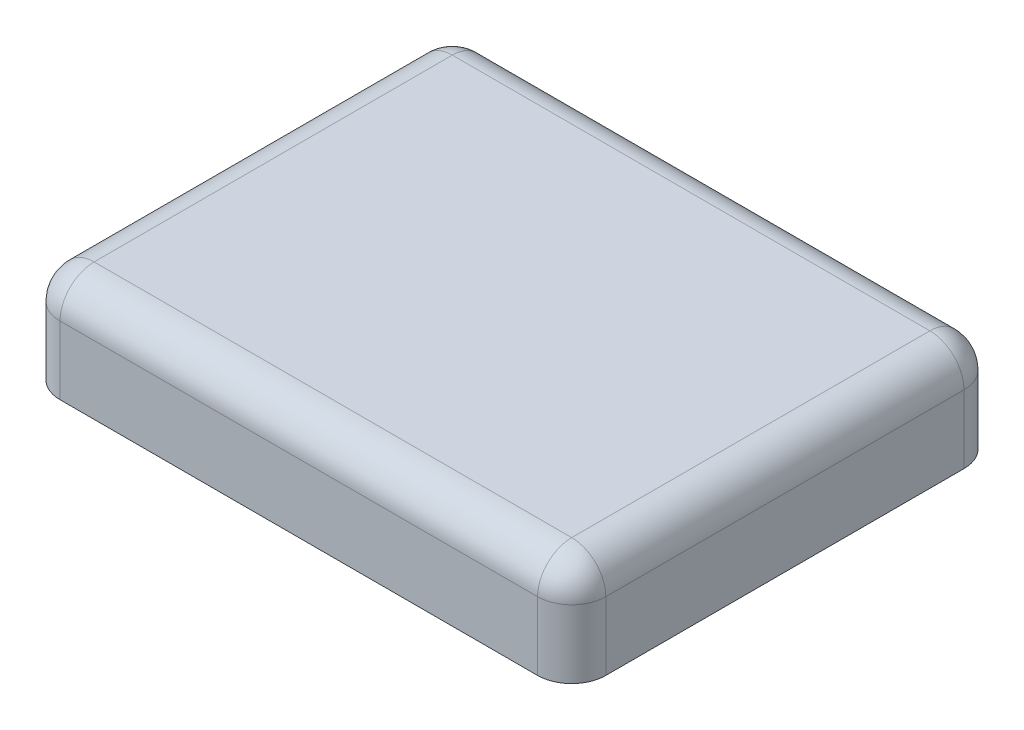
ISO-10303-21;
HEADER;
FILE_DESCRIPTION(('STEP AP214'),'2;1');
FILE_NAME('part.step','',(''),(''),'','','');
FILE_SCHEMA(('AUTOMOTIVE_DESIGN { 1 0 10303 214 1 1 1 1 }'));
ENDSEC;
DATA;
#1=APPLICATION_CONTEXT('core data for automotive mechanical design processes');
#2=APPLICATION_PROTOCOL_DEFINITION('international standard','automotive_design',2000,#1);
#3=PRODUCT_CONTEXT('',#1,'mechanical');
#4=PRODUCT('Part','Part','',(#3));
#5=PRODUCT_RELATED_PRODUCT_CATEGORY('part','',(#4));
#6=PRODUCT_DEFINITION_FORMATION('','',#4);
#7=PRODUCT_DEFINITION_CONTEXT('part definition',#1,'design');
#8=PRODUCT_DEFINITION('design','',#6,#7);
#9=PRODUCT_DEFINITION_SHAPE('','',#8);
#10=(LENGTH_UNIT() NAMED_UNIT(*) SI_UNIT(.MILLI.,.METRE.));
#11=(NAMED_UNIT(*) PLANE_ANGLE_UNIT() SI_UNIT($,.RADIAN.));
#12=(NAMED_UNIT(*) SI_UNIT($,.STERADIAN.) SOLID_ANGLE_UNIT());
#13=UNCERTAINTY_MEASURE_WITH_UNIT(LENGTH_MEASURE(1.E-05),#10,'distance_accuracy_value','');
#14=(GEOMETRIC_REPRESENTATION_CONTEXT(3) GLOBAL_UNCERTAINTY_ASSIGNED_CONTEXT((#13)) GLOBAL_UNIT_ASSIGNED_CONTEXT((#10,
#11,#12)) REPRESENTATION_CONTEXT('',''));
#15=CARTESIAN_POINT('',(0.,0.,0.));
#16=DIRECTION('',(0.,0.,1.));
#17=DIRECTION('',(1.,0.,0.));
#18=AXIS2_PLACEMENT_3D('',#15,#16,#17);
#19=CARTESIAN_POINT('',(1.6,0.6,-1.25));
#20=DIRECTION('',(-1.,0.,0.));
#21=DIRECTION('',(0.,0.,1.));
#22=AXIS2_PLACEMENT_3D('',#19,#20,#21);
#23=PLANE('',#22);
#24=DIRECTION('',(0.,-1.,0.));
#25=VECTOR('',#24,1.);
#26=CARTESIAN_POINT('',(1.6,0.6,-1.05));
#27=LINE('',#26,#25);
#28=CARTESIAN_POINT('',(1.6,0.,-1.05));
#29=VERTEX_POINT('',#28);
#30=CARTESIAN_POINT('',(1.6,0.4,-1.05));
#31=VERTEX_POINT('',#30);
#32=EDGE_CURVE('E123',#29,#31,#27,.F.);
#33=ORIENTED_EDGE('',*,*,#32,.T.);
#34=DIRECTION('',(0.,0.,-1.));
#35=VECTOR('',#34,1.);
#36=CARTESIAN_POINT('',(1.6,0.4,1.05));
#37=LINE('',#36,#35);
#38=CARTESIAN_POINT('',(1.6,0.4,1.05));
#39=VERTEX_POINT('',#38);
#40=EDGE_CURVE('E63',#31,#39,#37,.F.);
#41=ORIENTED_EDGE('',*,*,#40,.T.);
#42=DIRECTION('',(0.,-1.,0.));
#43=VECTOR('',#42,1.);
#44=CARTESIAN_POINT('',(1.6,0.6,1.05));
#45=LINE('',#44,#43);
#46=CARTESIAN_POINT('',(1.6,0.,1.05));
#47=VERTEX_POINT('',#46);
#48=EDGE_CURVE('E116',#39,#47,#45,.T.);
#49=ORIENTED_EDGE('',*,*,#48,.T.);
#50=DIRECTION('',(0.,0.,-1.));
#51=VECTOR('',#50,1.);
#52=CARTESIAN_POINT('',(1.6,0.,-1.25));
#53=LINE('',#52,#51);
#54=EDGE_CURVE('E119',#47,#29,#53,.T.);
#55=ORIENTED_EDGE('',*,*,#54,.T.);
#56=EDGE_LOOP('',(#33,#41,#49,#55));
#57=FACE_BOUND('',#56,.T.);
#58=ADVANCED_FACE('F39',(#57),#23,.F.);
#59=CARTESIAN_POINT('',(-1.6,0.6,-1.25));
#60=DIRECTION('',(0.,0.,1.));
#61=DIRECTION('',(1.,0.,0.));
#62=AXIS2_PLACEMENT_3D('',#59,#60,#61);
#63=PLANE('',#62);
#64=DIRECTION('',(0.,-1.,0.));
#65=VECTOR('',#64,1.);
#66=CARTESIAN_POINT('',(-1.4,0.6,-1.25));
#67=LINE('',#66,#65);
#68=CARTESIAN_POINT('',(-1.4,0.,-1.25));
#69=VERTEX_POINT('',#68);
#70=CARTESIAN_POINT('',(-1.4,0.4,-1.25));
#71=VERTEX_POINT('',#70);
#72=EDGE_CURVE('E156',#69,#71,#67,.F.);
#73=ORIENTED_EDGE('',*,*,#72,.T.);
#74=DIRECTION('',(-1.,0.,0.));
#75=VECTOR('',#74,1.);
#76=CARTESIAN_POINT('',(1.4,0.4,-1.25));
#77=LINE('',#76,#75);
#78=CARTESIAN_POINT('',(1.4,0.4,-1.25));
#79=VERTEX_POINT('',#78);
#80=EDGE_CURVE('E182',#71,#79,#77,.F.);
#81=ORIENTED_EDGE('',*,*,#80,.T.);
#82=DIRECTION('',(0.,-1.,0.));
#83=VECTOR('',#82,1.);
#84=CARTESIAN_POINT('',(1.4,0.6,-1.25));
#85=LINE('',#84,#83);
#86=CARTESIAN_POINT('',(1.4,0.,-1.25));
#87=VERTEX_POINT('',#86);
#88=EDGE_CURVE('E159',#79,#87,#85,.T.);
#89=ORIENTED_EDGE('',*,*,#88,.T.);
#90=DIRECTION('',(-1.,0.,0.));
#91=VECTOR('',#90,1.);
#92=CARTESIAN_POINT('',(-1.6,0.,-1.25));
#93=LINE('',#92,#91);
#94=EDGE_CURVE('E137',#87,#69,#93,.T.);
#95=ORIENTED_EDGE('',*,*,#94,.T.);
#96=EDGE_LOOP('',(#73,#81,#89,#95));
#97=FACE_BOUND('',#96,.T.);
#98=ADVANCED_FACE('F241',(#97),#63,.F.);
#99=CARTESIAN_POINT('',(-1.6,0.6,-1.25));
#100=DIRECTION('',(1.,0.,0.));
#101=DIRECTION('',(0.,0.,-1.));
#102=AXIS2_PLACEMENT_3D('',#99,#100,#101);
#103=PLANE('',#102);
#104=DIRECTION('',(0.,-1.,0.));
#105=VECTOR('',#104,1.);
#106=CARTESIAN_POINT('',(-1.6,0.6,1.05));
#107=LINE('',#106,#105);
#108=CARTESIAN_POINT('',(-1.6,0.,1.05));
#109=VERTEX_POINT('',#108);
#110=CARTESIAN_POINT('',(-1.6,0.4,1.05));
#111=VERTEX_POINT('',#110);
#112=EDGE_CURVE('E163',#109,#111,#107,.F.);
#113=ORIENTED_EDGE('',*,*,#112,.T.);
#114=DIRECTION('',(0.,0.,1.));
#115=VECTOR('',#114,1.);
#116=CARTESIAN_POINT('',(-1.6,0.4,-1.05));
#117=LINE('',#116,#115);
#118=CARTESIAN_POINT('',(-1.6,0.4,-1.05));
#119=VERTEX_POINT('',#118);
#120=EDGE_CURVE('E178',#111,#119,#117,.F.);
#121=ORIENTED_EDGE('',*,*,#120,.T.);
#122=DIRECTION('',(0.,-1.,0.));
#123=VECTOR('',#122,1.);
#124=CARTESIAN_POINT('',(-1.6,0.6,-1.05));
#125=LINE('',#124,#123);
#126=CARTESIAN_POINT('',(-1.6,0.,-1.05));
#127=VERTEX_POINT('',#126);
#128=EDGE_CURVE('E161',#119,#127,#125,.T.);
#129=ORIENTED_EDGE('',*,*,#128,.T.);
#130=DIRECTION('',(0.,0.,1.));
#131=VECTOR('',#130,1.);
#132=CARTESIAN_POINT('',(-1.6,0.,-1.25));
#133=LINE('',#132,#131);
#134=EDGE_CURVE('E140',#127,#109,#133,.T.);
#135=ORIENTED_EDGE('',*,*,#134,.T.);
#136=EDGE_LOOP('',(#113,#121,#129,#135));
#137=FACE_BOUND('',#136,.T.);
#138=ADVANCED_FACE('F246',(#137),#103,.F.);
#139=CARTESIAN_POINT('',(-1.6,0.6,1.25));
#140=DIRECTION('',(0.,0.,-1.));
#141=DIRECTION('',(-1.,0.,0.));
#142=AXIS2_PLACEMENT_3D('',#139,#140,#141);
#143=PLANE('',#142);
#144=DIRECTION('',(0.,-1.,0.));
#145=VECTOR('',#144,1.);
#146=CARTESIAN_POINT('',(1.4,0.6,1.25));
#147=LINE('',#146,#145);
#148=CARTESIAN_POINT('',(1.4,0.,1.25));
#149=VERTEX_POINT('',#148);
#150=CARTESIAN_POINT('',(1.4,0.4,1.25));
#151=VERTEX_POINT('',#150);
#152=EDGE_CURVE('E127',#149,#151,#147,.F.);
#153=ORIENTED_EDGE('',*,*,#152,.T.);
#154=DIRECTION('',(1.,0.,0.));
#155=VECTOR('',#154,1.);
#156=CARTESIAN_POINT('',(-1.4,0.4,1.25));
#157=LINE('',#156,#155);
#158=CARTESIAN_POINT('',(-1.4,0.4,1.25));
#159=VERTEX_POINT('',#158);
#160=EDGE_CURVE('E11',#151,#159,#157,.F.);
#161=ORIENTED_EDGE('',*,*,#160,.T.);
#162=DIRECTION('',(0.,-1.,0.));
#163=VECTOR('',#162,1.);
#164=CARTESIAN_POINT('',(-1.4,0.6,1.25));
#165=LINE('',#164,#163);
#166=CARTESIAN_POINT('',(-1.4,0.,1.25));
#167=VERTEX_POINT('',#166);
#168=EDGE_CURVE('E131',#159,#167,#165,.T.);
#169=ORIENTED_EDGE('',*,*,#168,.T.);
#170=DIRECTION('',(1.,0.,0.));
#171=VECTOR('',#170,1.);
#172=CARTESIAN_POINT('',(-1.6,0.,1.25));
#173=LINE('',#172,#171);
#174=EDGE_CURVE('E147',#167,#149,#173,.T.);
#175=ORIENTED_EDGE('',*,*,#174,.T.);
#176=EDGE_LOOP('',(#153,#161,#169,#175));
#177=FACE_BOUND('',#176,.T.);
#178=ADVANCED_FACE('F357',(#177),#143,.F.);
#179=CARTESIAN_POINT('',(0.,0.6,0.));
#180=DIRECTION('',(0.,1.,0.));
#181=DIRECTION('',(0.,0.,1.));
#182=AXIS2_PLACEMENT_3D('',#179,#180,#181);
#183=PLANE('',#182);
#184=DIRECTION('',(-1.,0.,0.));
#185=VECTOR('',#184,1.);
#186=CARTESIAN_POINT('',(-1.4,0.6,-1.05));
#187=LINE('',#186,#185);
#188=CARTESIAN_POINT('',(1.4,0.6,-1.05));
#189=VERTEX_POINT('',#188);
#190=CARTESIAN_POINT('',(-1.4,0.6,-1.05));
#191=VERTEX_POINT('',#190);
#192=EDGE_CURVE('E173',#189,#191,#187,.T.);
#193=ORIENTED_EDGE('',*,*,#192,.T.);
#194=DIRECTION('',(0.,0.,1.));
#195=VECTOR('',#194,1.);
#196=CARTESIAN_POINT('',(-1.4,0.6,1.05));
#197=LINE('',#196,#195);
#198=CARTESIAN_POINT('',(-1.4,0.6,1.05));
#199=VERTEX_POINT('',#198);
#200=EDGE_CURVE('E175',#191,#199,#197,.T.);
#201=ORIENTED_EDGE('',*,*,#200,.T.);
#202=DIRECTION('',(1.,0.,0.));
#203=VECTOR('',#202,1.);
#204=CARTESIAN_POINT('',(1.4,0.6,1.05));
#205=LINE('',#204,#203);
#206=CARTESIAN_POINT('',(1.4,0.6,1.05));
#207=VERTEX_POINT('',#206);
#208=EDGE_CURVE('E169',#199,#207,#205,.T.);
#209=ORIENTED_EDGE('',*,*,#208,.T.);
#210=DIRECTION('',(0.,0.,-1.));
#211=VECTOR('',#210,1.);
#212=CARTESIAN_POINT('',(1.4,0.6,-1.05));
#213=LINE('',#212,#211);
#214=EDGE_CURVE('E171',#207,#189,#213,.T.);
#215=ORIENTED_EDGE('',*,*,#214,.T.);
#216=EDGE_LOOP('',(#193,#201,#209,#215));
#217=FACE_BOUND('',#216,.T.);
#218=ADVANCED_FACE('F218',(#217),#183,.T.);
#219=CARTESIAN_POINT('',(0.,0.,0.));
#220=DIRECTION('',(0.,1.,0.));
#221=DIRECTION('',(0.,0.,1.));
#222=AXIS2_PLACEMENT_3D('',#219,#220,#221);
#223=PLANE('',#222);
#224=ORIENTED_EDGE('',*,*,#54,.F.);
#225=CARTESIAN_POINT('',(1.4,0.,1.05));
#226=DIRECTION('',(0.,1.,0.));
#227=DIRECTION('',(0.,0.,1.));
#228=AXIS2_PLACEMENT_3D('',#225,#226,#227);
#229=CIRCLE('',#228,0.2);
#230=EDGE_CURVE('E125',#47,#149,#229,.F.);
#231=ORIENTED_EDGE('',*,*,#230,.T.);
#232=ORIENTED_EDGE('',*,*,#174,.F.);
#233=CARTESIAN_POINT('',(-1.4,0.,1.05));
#234=DIRECTION('',(0.,1.,0.));
#235=DIRECTION('',(0.,0.,1.));
#236=AXIS2_PLACEMENT_3D('',#233,#234,#235);
#237=CIRCLE('',#236,0.2);
#238=EDGE_CURVE('E151',#167,#109,#237,.F.);
#239=ORIENTED_EDGE('',*,*,#238,.T.);
#240=ORIENTED_EDGE('',*,*,#134,.F.);
#241=CARTESIAN_POINT('',(-1.4,0.,-1.05));
#242=DIRECTION('',(0.,1.,0.));
#243=DIRECTION('',(0.,0.,1.));
#244=AXIS2_PLACEMENT_3D('',#241,#242,#243);
#245=CIRCLE('',#244,0.2);
#246=EDGE_CURVE('E122',#127,#69,#245,.F.);
#247=ORIENTED_EDGE('',*,*,#246,.T.);
#248=ORIENTED_EDGE('',*,*,#94,.F.);
#249=CARTESIAN_POINT('',(1.4,0.,-1.05));
#250=DIRECTION('',(0.,1.,0.));
#251=DIRECTION('',(0.,0.,1.));
#252=AXIS2_PLACEMENT_3D('',#249,#250,#251);
#253=CIRCLE('',#252,0.2);
#254=EDGE_CURVE('E132',#87,#29,#253,.F.);
#255=ORIENTED_EDGE('',*,*,#254,.T.);
#256=EDGE_LOOP('',(#224,#231,#232,#239,#240,#247,#248,#255));
#257=FACE_BOUND('',#256,.T.);
#258=ADVANCED_FACE('F134',(#257),#223,.F.);
#259=CARTESIAN_POINT('',(1.4,0.6,1.05));
#260=DIRECTION('',(0.,-1.,0.));
#261=DIRECTION('',(0.,0.,-1.));
#262=AXIS2_PLACEMENT_3D('',#259,#260,#261);
#263=CYLINDRICAL_SURFACE('',#262,0.2);
#264=ORIENTED_EDGE('',*,*,#48,.F.);
#265=CARTESIAN_POINT('',(1.4,0.4,1.05));
#266=DIRECTION('',(0.,-1.,0.));
#267=DIRECTION('',(0.,0.,-1.));
#268=AXIS2_PLACEMENT_3D('',#265,#266,#267);
#269=CIRCLE('',#268,0.2);
#270=EDGE_CURVE('E48',#39,#151,#269,.T.);
#271=ORIENTED_EDGE('',*,*,#270,.T.);
#272=ORIENTED_EDGE('',*,*,#152,.F.);
#273=ORIENTED_EDGE('',*,*,#230,.F.);
#274=EDGE_LOOP('',(#264,#271,#272,#273));
#275=FACE_BOUND('',#274,.T.);
#276=ADVANCED_FACE('F126',(#275),#263,.T.);
#277=CARTESIAN_POINT('',(1.4,0.6,-1.05));
#278=DIRECTION('',(0.,-1.,0.));
#279=DIRECTION('',(0.,0.,-1.));
#280=AXIS2_PLACEMENT_3D('',#277,#278,#279);
#281=CYLINDRICAL_SURFACE('',#280,0.2);
#282=ORIENTED_EDGE('',*,*,#88,.F.);
#283=CARTESIAN_POINT('',(1.4,0.4,-1.05));
#284=DIRECTION('',(0.,-1.,0.));
#285=DIRECTION('',(0.,0.,-1.));
#286=AXIS2_PLACEMENT_3D('',#283,#284,#285);
#287=CIRCLE('',#286,0.2);
#288=EDGE_CURVE('E184',#79,#31,#287,.T.);
#289=ORIENTED_EDGE('',*,*,#288,.T.);
#290=ORIENTED_EDGE('',*,*,#32,.F.);
#291=ORIENTED_EDGE('',*,*,#254,.F.);
#292=EDGE_LOOP('',(#282,#289,#290,#291));
#293=FACE_BOUND('',#292,.T.);
#294=ADVANCED_FACE('F253',(#293),#281,.T.);
#295=CARTESIAN_POINT('',(-1.4,0.6,1.05));
#296=DIRECTION('',(0.,-1.,0.));
#297=DIRECTION('',(0.,0.,-1.));
#298=AXIS2_PLACEMENT_3D('',#295,#296,#297);
#299=CYLINDRICAL_SURFACE('',#298,0.2);
#300=ORIENTED_EDGE('',*,*,#168,.F.);
#301=CARTESIAN_POINT('',(-1.4,0.4,1.05));
#302=DIRECTION('',(0.,-1.,0.));
#303=DIRECTION('',(0.,0.,-1.));
#304=AXIS2_PLACEMENT_3D('',#301,#302,#303);
#305=CIRCLE('',#304,0.2);
#306=EDGE_CURVE('E166',#159,#111,#305,.T.);
#307=ORIENTED_EDGE('',*,*,#306,.T.);
#308=ORIENTED_EDGE('',*,*,#112,.F.);
#309=ORIENTED_EDGE('',*,*,#238,.F.);
#310=EDGE_LOOP('',(#300,#307,#308,#309));
#311=FACE_BOUND('',#310,.T.);
#312=ADVANCED_FACE('F256',(#311),#299,.T.);
#313=CARTESIAN_POINT('',(-1.4,0.6,-1.05));
#314=DIRECTION('',(0.,-1.,0.));
#315=DIRECTION('',(0.,0.,-1.));
#316=AXIS2_PLACEMENT_3D('',#313,#314,#315);
#317=CYLINDRICAL_SURFACE('',#316,0.2);
#318=ORIENTED_EDGE('',*,*,#128,.F.);
#319=CARTESIAN_POINT('',(-1.4,0.4,-1.05));
#320=DIRECTION('',(0.,-1.,0.));
#321=DIRECTION('',(0.,0.,-1.));
#322=AXIS2_PLACEMENT_3D('',#319,#320,#321);
#323=CIRCLE('',#322,0.2);
#324=EDGE_CURVE('E180',#119,#71,#323,.T.);
#325=ORIENTED_EDGE('',*,*,#324,.T.);
#326=ORIENTED_EDGE('',*,*,#72,.F.);
#327=ORIENTED_EDGE('',*,*,#246,.F.);
#328=EDGE_LOOP('',(#318,#325,#326,#327));
#329=FACE_BOUND('',#328,.T.);
#330=ADVANCED_FACE('F260',(#329),#317,.T.);
#331=CARTESIAN_POINT('',(1.4,0.4,-1.05));
#332=DIRECTION('',(0.,1.,0.));
#333=DIRECTION('',(0.,0.,1.));
#334=AXIS2_PLACEMENT_3D('',#331,#332,#333);
#335=SPHERICAL_SURFACE('',#334,0.2);
#336=CARTESIAN_POINT('',(1.4,0.4,-1.05));
#337=DIRECTION('',(0.,0.,1.));
#338=DIRECTION('',(1.,0.,0.));
#339=AXIS2_PLACEMENT_3D('',#336,#337,#338);
#340=CIRCLE('',#339,0.2);
#341=EDGE_CURVE('E143',#31,#189,#340,.T.);
#342=ORIENTED_EDGE('',*,*,#341,.F.);
#343=ORIENTED_EDGE('',*,*,#288,.F.);
#344=CARTESIAN_POINT('',(1.4,0.4,-1.05));
#345=DIRECTION('',(-1.,0.,0.));
#346=DIRECTION('',(0.,0.,1.));
#347=AXIS2_PLACEMENT_3D('',#344,#345,#346);
#348=CIRCLE('',#347,0.2);
#349=EDGE_CURVE('E43',#189,#79,#348,.T.);
#350=ORIENTED_EDGE('',*,*,#349,.F.);
#351=EDGE_LOOP('',(#342,#343,#350));
#352=FACE_BOUND('',#351,.T.);
#353=ADVANCED_FACE('F41',(#352),#335,.T.);
#354=CARTESIAN_POINT('',(0.,0.4,-1.05));
#355=DIRECTION('',(1.,0.,0.));
#356=DIRECTION('',(0.,0.,-1.));
#357=AXIS2_PLACEMENT_3D('',#354,#355,#356);
#358=CYLINDRICAL_SURFACE('',#357,0.2);
#359=ORIENTED_EDGE('',*,*,#349,.T.);
#360=ORIENTED_EDGE('',*,*,#80,.F.);
#361=CARTESIAN_POINT('',(-1.4,0.4,-1.05));
#362=DIRECTION('',(-1.,0.,0.));
#363=DIRECTION('',(0.,0.,1.));
#364=AXIS2_PLACEMENT_3D('',#361,#362,#363);
#365=CIRCLE('',#364,0.2);
#366=EDGE_CURVE('E201',#191,#71,#365,.T.);
#367=ORIENTED_EDGE('',*,*,#366,.F.);
#368=ORIENTED_EDGE('',*,*,#192,.F.);
#369=EDGE_LOOP('',(#359,#360,#367,#368));
#370=FACE_BOUND('',#369,.T.);
#371=ADVANCED_FACE('F215',(#370),#358,.T.);
#372=CARTESIAN_POINT('',(1.4,0.4,0.));
#373=DIRECTION('',(0.,0.,1.));
#374=DIRECTION('',(1.,0.,0.));
#375=AXIS2_PLACEMENT_3D('',#372,#373,#374);
#376=CYLINDRICAL_SURFACE('',#375,0.2);
#377=ORIENTED_EDGE('',*,*,#341,.T.);
#378=ORIENTED_EDGE('',*,*,#214,.F.);
#379=CARTESIAN_POINT('',(1.4,0.4,1.05));
#380=DIRECTION('',(0.,0.,1.));
#381=DIRECTION('',(1.,0.,0.));
#382=AXIS2_PLACEMENT_3D('',#379,#380,#381);
#383=CIRCLE('',#382,0.2);
#384=EDGE_CURVE('E198',#39,#207,#383,.T.);
#385=ORIENTED_EDGE('',*,*,#384,.F.);
#386=ORIENTED_EDGE('',*,*,#40,.F.);
#387=EDGE_LOOP('',(#377,#378,#385,#386));
#388=FACE_BOUND('',#387,.T.);
#389=ADVANCED_FACE('F208',(#388),#376,.T.);
#390=CARTESIAN_POINT('',(-1.4,0.4,-1.05));
#391=DIRECTION('',(0.,1.,0.));
#392=DIRECTION('',(0.,0.,1.));
#393=AXIS2_PLACEMENT_3D('',#390,#391,#392);
#394=SPHERICAL_SURFACE('',#393,0.2);
#395=ORIENTED_EDGE('',*,*,#366,.T.);
#396=ORIENTED_EDGE('',*,*,#324,.F.);
#397=CARTESIAN_POINT('',(-1.4,0.4,-1.05));
#398=DIRECTION('',(0.,0.,1.));
#399=DIRECTION('',(1.,0.,0.));
#400=AXIS2_PLACEMENT_3D('',#397,#398,#399);
#401=CIRCLE('',#400,0.2);
#402=EDGE_CURVE('E195',#191,#119,#401,.T.);
#403=ORIENTED_EDGE('',*,*,#402,.F.);
#404=EDGE_LOOP('',(#395,#396,#403));
#405=FACE_BOUND('',#404,.T.);
#406=ADVANCED_FACE('F230',(#405),#394,.T.);
#407=CARTESIAN_POINT('',(1.4,0.4,1.05));
#408=DIRECTION('',(0.,1.,0.));
#409=DIRECTION('',(0.,0.,1.));
#410=AXIS2_PLACEMENT_3D('',#407,#408,#409);
#411=SPHERICAL_SURFACE('',#410,0.2);
#412=ORIENTED_EDGE('',*,*,#270,.F.);
#413=ORIENTED_EDGE('',*,*,#384,.T.);
#414=CARTESIAN_POINT('',(1.4,0.4,1.05));
#415=DIRECTION('',(-1.,0.,0.));
#416=DIRECTION('',(0.,0.,1.));
#417=AXIS2_PLACEMENT_3D('',#414,#415,#416);
#418=CIRCLE('',#417,0.2);
#419=EDGE_CURVE('E192',#151,#207,#418,.T.);
#420=ORIENTED_EDGE('',*,*,#419,.F.);
#421=EDGE_LOOP('',(#412,#413,#420));
#422=FACE_BOUND('',#421,.T.);
#423=ADVANCED_FACE('F227',(#422),#411,.T.);
#424=CARTESIAN_POINT('',(-1.4,0.4,0.));
#425=DIRECTION('',(0.,0.,-1.));
#426=DIRECTION('',(-1.,0.,0.));
#427=AXIS2_PLACEMENT_3D('',#424,#425,#426);
#428=CYLINDRICAL_SURFACE('',#427,0.2);
#429=ORIENTED_EDGE('',*,*,#402,.T.);
#430=ORIENTED_EDGE('',*,*,#120,.F.);
#431=CARTESIAN_POINT('',(-1.4,0.4,1.05));
#432=DIRECTION('',(0.,0.,1.));
#433=DIRECTION('',(1.,0.,0.));
#434=AXIS2_PLACEMENT_3D('',#431,#432,#433);
#435=CIRCLE('',#434,0.2);
#436=EDGE_CURVE('E190',#199,#111,#435,.T.);
#437=ORIENTED_EDGE('',*,*,#436,.F.);
#438=ORIENTED_EDGE('',*,*,#200,.F.);
#439=EDGE_LOOP('',(#429,#430,#437,#438));
#440=FACE_BOUND('',#439,.T.);
#441=ADVANCED_FACE('F229',(#440),#428,.T.);
#442=CARTESIAN_POINT('',(0.,0.4,1.05));
#443=DIRECTION('',(-1.,0.,0.));
#444=DIRECTION('',(0.,0.,1.));
#445=AXIS2_PLACEMENT_3D('',#442,#443,#444);
#446=CYLINDRICAL_SURFACE('',#445,0.2);
#447=ORIENTED_EDGE('',*,*,#419,.T.);
#448=ORIENTED_EDGE('',*,*,#208,.F.);
#449=CARTESIAN_POINT('',(-1.4,0.4,1.05));
#450=DIRECTION('',(-1.,0.,0.));
#451=DIRECTION('',(0.,0.,1.));
#452=AXIS2_PLACEMENT_3D('',#449,#450,#451);
#453=CIRCLE('',#452,0.2);
#454=EDGE_CURVE('E188',#159,#199,#453,.T.);
#455=ORIENTED_EDGE('',*,*,#454,.F.);
#456=ORIENTED_EDGE('',*,*,#160,.F.);
#457=EDGE_LOOP('',(#447,#448,#455,#456));
#458=FACE_BOUND('',#457,.T.);
#459=ADVANCED_FACE('F223',(#458),#446,.T.);
#460=CARTESIAN_POINT('',(-1.4,0.4,1.05));
#461=DIRECTION('',(0.,1.,0.));
#462=DIRECTION('',(0.,0.,1.));
#463=AXIS2_PLACEMENT_3D('',#460,#461,#462);
#464=SPHERICAL_SURFACE('',#463,0.2);
#465=ORIENTED_EDGE('',*,*,#436,.T.);
#466=ORIENTED_EDGE('',*,*,#306,.F.);
#467=ORIENTED_EDGE('',*,*,#454,.T.);
#468=EDGE_LOOP('',(#465,#466,#467));
#469=FACE_BOUND('',#468,.T.);
#470=ADVANCED_FACE('F265',(#469),#464,.T.);
#471=CLOSED_SHELL('',(#58,#98,#138,#178,#218,#258,#276,#294,#312,#330,#353,#371,#389,#406,#423,
#441,#459,#470));
#472=MANIFOLD_SOLID_BREP('B2',#471);
#473=ADVANCED_BREP_SHAPE_REPRESENTATION('',(#18,#472),#14);
#474=SHAPE_DEFINITION_REPRESENTATION(#9,#473);
ENDSEC;
END-ISO-10303-21;
